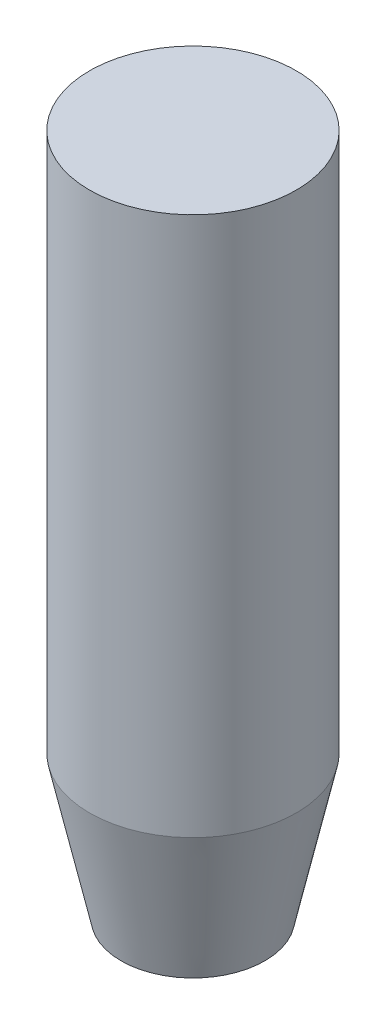
ISO-10303-21;
HEADER;
FILE_DESCRIPTION(('STEP AP214'),'2;1');
FILE_NAME('part.step','',(''),(''),'','','');
FILE_SCHEMA(('AUTOMOTIVE_DESIGN { 1 0 10303 214 1 1 1 1 }'));
ENDSEC;
DATA;
#1=APPLICATION_CONTEXT('core data for automotive mechanical design processes');
#2=APPLICATION_PROTOCOL_DEFINITION('international standard','automotive_design',2000,#1);
#3=PRODUCT_CONTEXT('',#1,'mechanical');
#4=PRODUCT('Part','Part','',(#3));
#5=PRODUCT_RELATED_PRODUCT_CATEGORY('part','',(#4));
#6=PRODUCT_DEFINITION_FORMATION('','',#4);
#7=PRODUCT_DEFINITION_CONTEXT('part definition',#1,'design');
#8=PRODUCT_DEFINITION('design','',#6,#7);
#9=PRODUCT_DEFINITION_SHAPE('','',#8);
#10=(LENGTH_UNIT() NAMED_UNIT(*) SI_UNIT(.MILLI.,.METRE.));
#11=(NAMED_UNIT(*) PLANE_ANGLE_UNIT() SI_UNIT($,.RADIAN.));
#12=(NAMED_UNIT(*) SI_UNIT($,.STERADIAN.) SOLID_ANGLE_UNIT());
#13=UNCERTAINTY_MEASURE_WITH_UNIT(LENGTH_MEASURE(1.E-05),#10,'distance_accuracy_value','');
#14=(GEOMETRIC_REPRESENTATION_CONTEXT(3) GLOBAL_UNCERTAINTY_ASSIGNED_CONTEXT((#13)) GLOBAL_UNIT_ASSIGNED_CONTEXT((#10,
#11,#12)) REPRESENTATION_CONTEXT('',''));
#15=CARTESIAN_POINT('',(0.,0.,0.));
#16=DIRECTION('',(0.,0.,1.));
#17=DIRECTION('',(1.,0.,0.));
#18=AXIS2_PLACEMENT_3D('',#15,#16,#17);
#19=CARTESIAN_POINT('',(0.,120.65,0.));
#20=DIRECTION('',(0.,-1.,0.));
#21=DIRECTION('',(0.,0.,-1.));
#22=AXIS2_PLACEMENT_3D('',#19,#20,#21);
#23=CYLINDRICAL_SURFACE('',#22,18.25625);
#24=CARTESIAN_POINT('',(0.,25.4000000000012,0.));
#25=DIRECTION('',(0.,1.,0.));
#26=DIRECTION('',(0.,0.,1.));
#27=AXIS2_PLACEMENT_3D('',#24,#25,#26);
#28=CIRCLE('',#27,18.25625);
#29=CARTESIAN_POINT('',(0.,25.4000000000012,18.25625));
#30=VERTEX_POINT('',#29);
#31=EDGE_CURVE('E39',#30,#30,#28,.T.);
#32=ORIENTED_EDGE('',*,*,#31,.T.);
#33=EDGE_LOOP('',(#32));
#34=FACE_BOUND('',#33,.T.);
#35=CARTESIAN_POINT('',(0.,120.65,0.));
#36=DIRECTION('',(0.,1.,0.));
#37=DIRECTION('',(0.,0.,1.));
#38=AXIS2_PLACEMENT_3D('',#35,#36,#37);
#39=CIRCLE('',#38,18.25625);
#40=CARTESIAN_POINT('',(0.,120.65,18.25625));
#41=VERTEX_POINT('',#40);
#42=EDGE_CURVE('E43',#41,#41,#39,.T.);
#43=ORIENTED_EDGE('',*,*,#42,.F.);
#44=EDGE_LOOP('',(#43));
#45=FACE_BOUND('',#44,.T.);
#46=ADVANCED_FACE('F32',(#34,#45),#23,.T.);
#47=CARTESIAN_POINT('',(0.,120.65,0.));
#48=DIRECTION('',(0.,1.,0.));
#49=DIRECTION('',(0.,0.,1.));
#50=AXIS2_PLACEMENT_3D('',#47,#48,#49);
#51=PLANE('',#50);
#52=ORIENTED_EDGE('',*,*,#42,.T.);
#53=EDGE_LOOP('',(#52));
#54=FACE_BOUND('',#53,.T.);
#55=ADVANCED_FACE('F50',(#54),#51,.T.);
#56=CARTESIAN_POINT('',(0.,0.,0.));
#57=DIRECTION('',(0.,1.,0.));
#58=DIRECTION('',(0.,0.,1.));
#59=AXIS2_PLACEMENT_3D('',#56,#57,#58);
#60=PLANE('',#59);
#61=CARTESIAN_POINT('',(0.,0.,0.));
#62=DIRECTION('',(0.,1.,0.));
#63=DIRECTION('',(0.,0.,1.));
#64=AXIS2_PLACEMENT_3D('',#61,#62,#63);
#65=CIRCLE('',#64,12.6999999999998);
#66=CARTESIAN_POINT('',(0.,0.,12.6999999999998));
#67=VERTEX_POINT('',#66);
#68=EDGE_CURVE('E10',#67,#67,#65,.F.);
#69=ORIENTED_EDGE('',*,*,#68,.T.);
#70=EDGE_LOOP('',(#69));
#71=FACE_BOUND('',#70,.T.);
#72=ADVANCED_FACE('F56',(#71),#60,.F.);
#73=CARTESIAN_POINT('',(0.,25.4000000000012,0.));
#74=DIRECTION('',(0.,1.,0.));
#75=DIRECTION('',(0.,0.,1.));
#76=AXIS2_PLACEMENT_3D('',#73,#74,#75);
#77=CONICAL_SURFACE('',#76,18.25625,0.215357699697737);
#78=ORIENTED_EDGE('',*,*,#68,.F.);
#79=EDGE_LOOP('',(#78));
#80=FACE_BOUND('',#79,.T.);
#81=ORIENTED_EDGE('',*,*,#31,.F.);
#82=EDGE_LOOP('',(#81));
#83=FACE_BOUND('',#82,.T.);
#84=ADVANCED_FACE('F34',(#80,#83),#77,.T.);
#85=CLOSED_SHELL('',(#46,#55,#72,#84));
#86=MANIFOLD_SOLID_BREP('B2',#85);
#87=ADVANCED_BREP_SHAPE_REPRESENTATION('',(#18,#86),#14);
#88=SHAPE_DEFINITION_REPRESENTATION(#9,#87);
ENDSEC;
END-ISO-10303-21;
